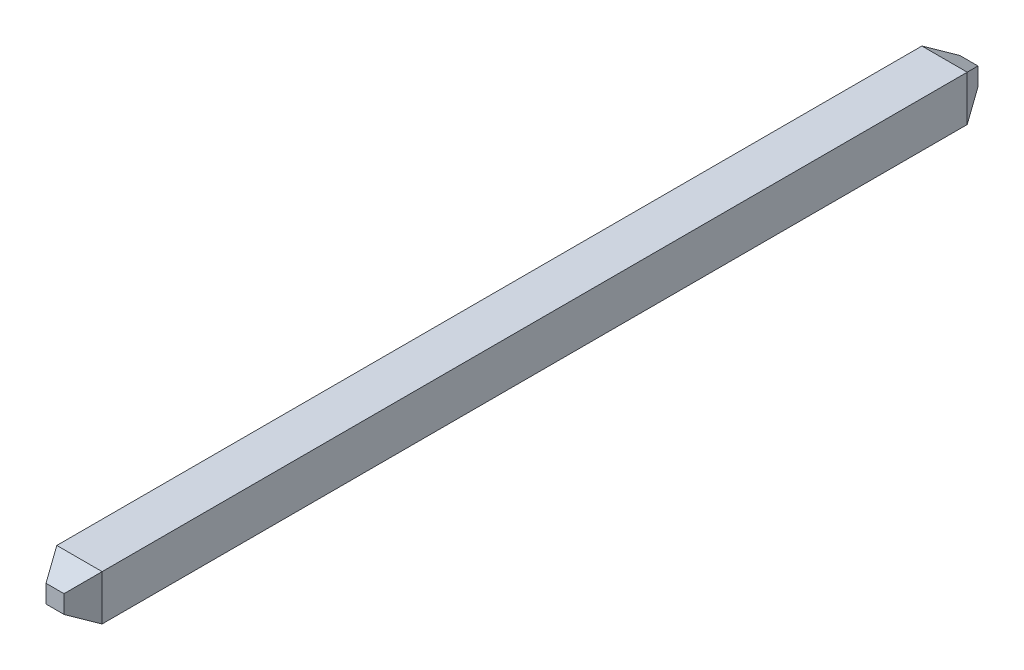
ISO-10303-21;
HEADER;
FILE_DESCRIPTION(('STEP AP214'),'2;1');
FILE_NAME('part.step','',(''),(''),'','','');
FILE_SCHEMA(('AUTOMOTIVE_DESIGN { 1 0 10303 214 1 1 1 1 }'));
ENDSEC;
DATA;
#1=APPLICATION_CONTEXT('core data for automotive mechanical design processes');
#2=APPLICATION_PROTOCOL_DEFINITION('international standard','automotive_design',2000,#1);
#3=PRODUCT_CONTEXT('',#1,'mechanical');
#4=PRODUCT('Part','Part','',(#3));
#5=PRODUCT_RELATED_PRODUCT_CATEGORY('part','',(#4));
#6=PRODUCT_DEFINITION_FORMATION('','',#4);
#7=PRODUCT_DEFINITION_CONTEXT('part definition',#1,'design');
#8=PRODUCT_DEFINITION('design','',#6,#7);
#9=PRODUCT_DEFINITION_SHAPE('','',#8);
#10=(LENGTH_UNIT() NAMED_UNIT(*) SI_UNIT(.MILLI.,.METRE.));
#11=(NAMED_UNIT(*) PLANE_ANGLE_UNIT() SI_UNIT($,.RADIAN.));
#12=(NAMED_UNIT(*) SI_UNIT($,.STERADIAN.) SOLID_ANGLE_UNIT());
#13=UNCERTAINTY_MEASURE_WITH_UNIT(LENGTH_MEASURE(1.E-05),#10,'distance_accuracy_value','');
#14=(GEOMETRIC_REPRESENTATION_CONTEXT(3) GLOBAL_UNCERTAINTY_ASSIGNED_CONTEXT((#13)) GLOBAL_UNIT_ASSIGNED_CONTEXT((#10,
#11,#12)) REPRESENTATION_CONTEXT('',''));
#15=CARTESIAN_POINT('',(0.,0.,0.));
#16=DIRECTION('',(0.,0.,1.));
#17=DIRECTION('',(1.,0.,0.));
#18=AXIS2_PLACEMENT_3D('',#15,#16,#17);
#19=CARTESIAN_POINT('',(7.74011510041924,0.945,-3.20872569516347));
#20=DIRECTION('',(0.872569516347452,0.,-0.488489958076083));
#21=DIRECTION('',(-0.488489958076083,0.,-0.872569516347452));
#22=AXIS2_PLACEMENT_3D('',#19,#20,#21);
#23=PLANE('',#22);
#24=DIRECTION('',(0.,1.,0.));
#25=VECTOR('',#24,1.);
#26=CARTESIAN_POINT('',(7.93534185664469,0.944999999999999,-2.86000017186176));
#27=LINE('',#26,#25);
#28=CARTESIAN_POINT('',(7.93534185663263,0.954999975315067,-2.85999984563027));
#29=VERTEX_POINT('',#28);
#30=CARTESIAN_POINT('',(7.93534201729187,1.58500016035866,-2.8599998849043));
#31=VERTEX_POINT('',#30);
#32=EDGE_CURVE('E146',#29,#31,#27,.T.);
#33=ORIENTED_EDGE('',*,*,#32,.F.);
#34=DIRECTION('',(0.43907261756865,-0.438284036988111,0.784297353956278));
#35=VECTOR('',#34,1.);
#36=CARTESIAN_POINT('',(7.745,1.145,-3.2));
#37=LINE('',#36,#35);
#38=CARTESIAN_POINT('',(7.745,1.145,-3.2));
#39=VERTEX_POINT('',#38);
#40=EDGE_CURVE('E143',#39,#29,#37,.T.);
#41=ORIENTED_EDGE('',*,*,#40,.F.);
#42=DIRECTION('',(0.,1.,0.));
#43=VECTOR('',#42,1.);
#44=CARTESIAN_POINT('',(7.745,1.135,-3.2));
#45=LINE('',#44,#43);
#46=CARTESIAN_POINT('',(7.745,1.395,-3.2));
#47=VERTEX_POINT('',#46);
#48=EDGE_CURVE('E95',#47,#39,#45,.F.);
#49=ORIENTED_EDGE('',*,*,#48,.F.);
#50=DIRECTION('',(-0.439072617568649,-0.438284036988111,-0.784297353956278));
#51=VECTOR('',#50,1.);
#52=CARTESIAN_POINT('',(7.93534185664468,1.585,-2.86000017186176));
#53=LINE('',#52,#51);
#54=EDGE_CURVE('E135',#31,#47,#53,.T.);
#55=ORIENTED_EDGE('',*,*,#54,.F.);
#56=EDGE_LOOP('',(#33,#41,#49,#55));
#57=FACE_BOUND('',#56,.T.);
#58=ADVANCED_FACE('F16',(#57),#23,.T.);
#59=CARTESIAN_POINT('',(7.74036702814295,0.945,9.50441734607014));
#60=DIRECTION('',(0.873317045523298,0.,0.487152273933376));
#61=DIRECTION('',(0.487152273933376,0.,-0.873317045523298));
#62=AXIS2_PLACEMENT_3D('',#59,#60,#61);
#63=PLANE('',#62);
#64=DIRECTION('',(-0.437799852400912,0.438586917260842,0.784839349959832));
#65=VECTOR('',#64,1.);
#66=CARTESIAN_POINT('',(7.93489789955165,0.954999686828527,9.15568378706484));
#67=LINE('',#66,#65);
#68=CARTESIAN_POINT('',(7.93489765454993,0.954999891076847,9.15568368845102));
#69=VERTEX_POINT('',#68);
#70=CARTESIAN_POINT('',(7.74523855088228,1.145,9.49568417561491));
#71=VERTEX_POINT('',#70);
#72=EDGE_CURVE('E152',#69,#71,#67,.T.);
#73=ORIENTED_EDGE('',*,*,#72,.F.);
#74=DIRECTION('',(0.,1.,0.));
#75=VECTOR('',#74,1.);
#76=CARTESIAN_POINT('',(7.93489853900643,0.944999999999999,9.15568372243698));
#77=LINE('',#76,#75);
#78=CARTESIAN_POINT('',(7.93489765280461,1.5850001770326,9.15568371270385));
#79=VERTEX_POINT('',#78);
#80=EDGE_CURVE('E106',#79,#69,#77,.F.);
#81=ORIENTED_EDGE('',*,*,#80,.F.);
#82=DIRECTION('',(0.437799852400914,0.438586917260841,-0.784839349959831));
#83=VECTOR('',#82,1.);
#84=CARTESIAN_POINT('',(7.74523855088228,1.395,9.49568417561491));
#85=LINE('',#84,#83);
#86=CARTESIAN_POINT('',(7.74523855088228,1.395,9.49568417561491));
#87=VERTEX_POINT('',#86);
#88=EDGE_CURVE('E101',#87,#79,#85,.T.);
#89=ORIENTED_EDGE('',*,*,#88,.F.);
#90=DIRECTION('',(0.,1.,0.));
#91=VECTOR('',#90,1.);
#92=CARTESIAN_POINT('',(7.74523855088228,1.405,9.49568417561491));
#93=LINE('',#92,#91);
#94=EDGE_CURVE('E19',#71,#87,#93,.T.);
#95=ORIENTED_EDGE('',*,*,#94,.F.);
#96=EDGE_LOOP('',(#73,#81,#89,#95));
#97=FACE_BOUND('',#96,.T.);
#98=ADVANCED_FACE('F103',(#97),#63,.T.);
#99=CARTESIAN_POINT('',(7.48523855088228,1.405,9.49568417561491));
#100=DIRECTION('',(0.,0.,1.));
#101=DIRECTION('',(1.,0.,0.));
#102=AXIS2_PLACEMENT_3D('',#99,#100,#101);
#103=PLANE('',#102);
#104=DIRECTION('',(1.,0.,0.));
#105=VECTOR('',#104,1.);
#106=CARTESIAN_POINT('',(7.2948966942376,1.395,9.49568417561491));
#107=LINE('',#106,#105);
#108=CARTESIAN_POINT('',(7.49523855088228,1.395,9.49568417561491));
#109=VERTEX_POINT('',#108);
#110=EDGE_CURVE('E111',#109,#87,#107,.T.);
#111=ORIENTED_EDGE('',*,*,#110,.F.);
#112=DIRECTION('',(0.,1.,0.));
#113=VECTOR('',#112,1.);
#114=CARTESIAN_POINT('',(7.49523855088228,0.945,9.49568417561491));
#115=LINE('',#114,#113);
#116=CARTESIAN_POINT('',(7.49523855088228,1.145,9.49568417561491));
#117=VERTEX_POINT('',#116);
#118=EDGE_CURVE('E162',#117,#109,#115,.T.);
#119=ORIENTED_EDGE('',*,*,#118,.F.);
#120=DIRECTION('',(1.,0.,0.));
#121=VECTOR('',#120,1.);
#122=CARTESIAN_POINT('',(7.2948966942376,1.145,9.49568417561491));
#123=LINE('',#122,#121);
#124=EDGE_CURVE('E116',#71,#117,#123,.F.);
#125=ORIENTED_EDGE('',*,*,#124,.F.);
#126=ORIENTED_EDGE('',*,*,#94,.T.);
#127=EDGE_LOOP('',(#111,#119,#125,#126));
#128=FACE_BOUND('',#127,.T.);
#129=ADVANCED_FACE('F113',(#128),#103,.T.);
#130=CARTESIAN_POINT('',(7.2948966942376,1.39012178454432,9.50441360938624));
#131=DIRECTION('',(0.,0.872943377132664,0.487821545567864));
#132=DIRECTION('',(0.,-0.487821545567864,0.872943377132664));
#133=AXIS2_PLACEMENT_3D('',#130,#131,#132);
#134=PLANE('',#133);
#135=DIRECTION('',(-0.439072459537927,0.438284700441663,-0.784297071672512));
#136=VECTOR('',#135,1.);
#137=CARTESIAN_POINT('',(7.49523855088228,1.395,9.49568417561491));
#138=LINE('',#137,#136);
#139=CARTESIAN_POINT('',(7.3048975037028,1.58500008247258,9.15568447138296));
#140=VERTEX_POINT('',#139);
#141=EDGE_CURVE('E121',#109,#140,#138,.T.);
#142=ORIENTED_EDGE('',*,*,#141,.F.);
#143=ORIENTED_EDGE('',*,*,#110,.T.);
#144=ORIENTED_EDGE('',*,*,#88,.T.);
#145=DIRECTION('',(1.,0.,0.));
#146=VECTOR('',#145,1.);
#147=CARTESIAN_POINT('',(7.62006658937282,1.585,9.15568497320463));
#148=LINE('',#147,#146);
#149=EDGE_CURVE('E165',#140,#79,#148,.T.);
#150=ORIENTED_EDGE('',*,*,#149,.F.);
#151=EDGE_LOOP('',(#142,#143,#144,#150));
#152=FACE_BOUND('',#151,.T.);
#153=ADVANCED_FACE('F119',(#152),#134,.T.);
#154=CARTESIAN_POINT('',(7.485,1.135,-3.2));
#155=DIRECTION('',(0.,0.,-1.));
#156=DIRECTION('',(-1.,0.,0.));
#157=AXIS2_PLACEMENT_3D('',#154,#155,#156);
#158=PLANE('',#157);
#159=ORIENTED_EDGE('',*,*,#48,.T.);
#160=DIRECTION('',(1.,0.,0.));
#161=VECTOR('',#160,1.);
#162=CARTESIAN_POINT('',(7.29534185664468,1.145,-3.2));
#163=LINE('',#162,#161);
#164=CARTESIAN_POINT('',(7.495,1.145,-3.2));
#165=VERTEX_POINT('',#164);
#166=EDGE_CURVE('E139',#165,#39,#163,.T.);
#167=ORIENTED_EDGE('',*,*,#166,.F.);
#168=DIRECTION('',(0.,1.,0.));
#169=VECTOR('',#168,1.);
#170=CARTESIAN_POINT('',(7.49500000000001,0.945,-3.2));
#171=LINE('',#170,#169);
#172=CARTESIAN_POINT('',(7.495,1.395,-3.2));
#173=VERTEX_POINT('',#172);
#174=EDGE_CURVE('E177',#173,#165,#171,.F.);
#175=ORIENTED_EDGE('',*,*,#174,.F.);
#176=DIRECTION('',(1.,0.,0.));
#177=VECTOR('',#176,1.);
#178=CARTESIAN_POINT('',(7.29534185664468,1.395,-3.2));
#179=LINE('',#178,#177);
#180=EDGE_CURVE('E129',#47,#173,#179,.F.);
#181=ORIENTED_EDGE('',*,*,#180,.F.);
#182=EDGE_LOOP('',(#159,#167,#175,#181));
#183=FACE_BOUND('',#182,.T.);
#184=ADVANCED_FACE('F229',(#183),#158,.T.);
#185=CARTESIAN_POINT('',(7.29534185664468,1.58987821545568,-2.85127073809043));
#186=DIRECTION('',(0.,0.872943377132663,-0.487821545567865));
#187=DIRECTION('',(0.,0.487821545567865,0.872943377132663));
#188=AXIS2_PLACEMENT_3D('',#185,#186,#187);
#189=PLANE('',#188);
#190=DIRECTION('',(1.,0.,0.));
#191=VECTOR('',#190,1.);
#192=CARTESIAN_POINT('',(7.62006658937282,1.585,-2.86000017186176));
#193=LINE('',#192,#191);
#194=CARTESIAN_POINT('',(7.30534144768619,1.58500070680911,-2.8599984305592));
#195=VERTEX_POINT('',#194);
#196=EDGE_CURVE('E173',#31,#195,#193,.F.);
#197=ORIENTED_EDGE('',*,*,#196,.F.);
#198=ORIENTED_EDGE('',*,*,#54,.T.);
#199=ORIENTED_EDGE('',*,*,#180,.T.);
#200=DIRECTION('',(0.437798396819596,-0.43858642908966,-0.784840434713052));
#201=VECTOR('',#200,1.);
#202=CARTESIAN_POINT('',(7.30534066407532,1.58500072063078,-2.8599980339447));
#203=LINE('',#202,#201);
#204=EDGE_CURVE('E184',#195,#173,#203,.T.);
#205=ORIENTED_EDGE('',*,*,#204,.F.);
#206=EDGE_LOOP('',(#197,#198,#199,#205));
#207=FACE_BOUND('',#206,.T.);
#208=ADVANCED_FACE('F227',(#207),#189,.T.);
#209=CARTESIAN_POINT('',(7.29534185664468,1.14987821545568,-3.20872943377133));
#210=DIRECTION('',(0.,-0.872943377132663,-0.487821545567865));
#211=DIRECTION('',(0.,0.487821545567865,-0.872943377132663));
#212=AXIS2_PLACEMENT_3D('',#209,#210,#211);
#213=PLANE('',#212);
#214=ORIENTED_EDGE('',*,*,#166,.T.);
#215=ORIENTED_EDGE('',*,*,#40,.T.);
#216=DIRECTION('',(1.,0.,0.));
#217=VECTOR('',#216,1.);
#218=CARTESIAN_POINT('',(7.29494834685547,0.955,-2.85999756200982));
#219=LINE('',#218,#217);
#220=CARTESIAN_POINT('',(7.30534198218489,0.954999729763457,-2.85999898491791));
#221=VERTEX_POINT('',#220);
#222=EDGE_CURVE('E39',#221,#29,#219,.T.);
#223=ORIENTED_EDGE('',*,*,#222,.F.);
#224=DIRECTION('',(-0.437798396819595,-0.438586429089664,0.78484043471305));
#225=VECTOR('',#224,1.);
#226=CARTESIAN_POINT('',(7.49500000000001,1.145,-3.2));
#227=LINE('',#226,#225);
#228=EDGE_CURVE('E181',#165,#221,#227,.T.);
#229=ORIENTED_EDGE('',*,*,#228,.F.);
#230=EDGE_LOOP('',(#214,#215,#223,#229));
#231=FACE_BOUND('',#230,.T.);
#232=ADVANCED_FACE('F230',(#231),#213,.T.);
#233=CARTESIAN_POINT('',(7.93534630826876,0.944999999999999,-2.98065701705514));
#234=DIRECTION('',(0.999999999319383,0.,3.68949151671205E-05));
#235=DIRECTION('',(3.68949151671205E-05,0.,-0.999999999319383));
#236=AXIS2_PLACEMENT_3D('',#233,#234,#235);
#237=PLANE('',#236);
#238=DIRECTION('',(3.69481335090154E-05,0.,-0.999999999317418));
#239=VECTOR('',#238,1.);
#240=CARTESIAN_POINT('',(7.93489789955165,1.585,9.15568372241339));
#241=LINE('',#240,#239);
#242=EDGE_CURVE('E169',#79,#31,#241,.T.);
#243=ORIENTED_EDGE('',*,*,#242,.F.);
#244=ORIENTED_EDGE('',*,*,#80,.T.);
#245=DIRECTION('',(-3.69481335090154E-05,0.,0.999999999317418));
#246=VECTOR('',#245,1.);
#247=CARTESIAN_POINT('',(7.93534185664468,0.955,-2.86000017186176));
#248=LINE('',#247,#246);
#249=EDGE_CURVE('E190',#29,#69,#248,.T.);
#250=ORIENTED_EDGE('',*,*,#249,.F.);
#251=ORIENTED_EDGE('',*,*,#32,.T.);
#252=EDGE_LOOP('',(#243,#244,#250,#251));
#253=FACE_BOUND('',#252,.T.);
#254=ADVANCED_FACE('F232',(#253),#237,.T.);
#255=CARTESIAN_POINT('',(7.2948966942376,0.950121784544321,9.14695491370534));
#256=DIRECTION('',(0.,-0.872943377132664,0.487821545567865));
#257=DIRECTION('',(0.,-0.487821545567865,-0.872943377132664));
#258=AXIS2_PLACEMENT_3D('',#255,#256,#257);
#259=PLANE('',#258);
#260=ORIENTED_EDGE('',*,*,#124,.T.);
#261=DIRECTION('',(0.439072459537929,0.438284700441656,0.784297071672515));
#262=VECTOR('',#261,1.);
#263=CARTESIAN_POINT('',(7.30489724886555,0.955000197635094,9.15568533818574));
#264=LINE('',#263,#262);
#265=CARTESIAN_POINT('',(7.30489781760238,0.955000116075706,9.15568487573227));
#266=VERTEX_POINT('',#265);
#267=EDGE_CURVE('E158',#266,#117,#264,.T.);
#268=ORIENTED_EDGE('',*,*,#267,.F.);
#269=DIRECTION('',(1.,0.,0.));
#270=VECTOR('',#269,1.);
#271=CARTESIAN_POINT('',(7.29494834685547,0.955,9.15568372241339));
#272=LINE('',#271,#270);
#273=EDGE_CURVE('E194',#69,#266,#272,.F.);
#274=ORIENTED_EDGE('',*,*,#273,.F.);
#275=ORIENTED_EDGE('',*,*,#72,.T.);
#276=EDGE_LOOP('',(#260,#268,#274,#275));
#277=FACE_BOUND('',#276,.T.);
#278=ADVANCED_FACE('F219',(#277),#259,.T.);
#279=CARTESIAN_POINT('',(7.50012345046305,0.945,9.50440987077839));
#280=DIRECTION('',(-0.872569516347454,0.,0.48848995807608));
#281=DIRECTION('',(0.48848995807608,0.,0.872569516347454));
#282=AXIS2_PLACEMENT_3D('',#279,#280,#281);
#283=PLANE('',#282);
#284=ORIENTED_EDGE('',*,*,#267,.T.);
#285=ORIENTED_EDGE('',*,*,#118,.T.);
#286=ORIENTED_EDGE('',*,*,#141,.T.);
#287=DIRECTION('',(0.,1.,0.));
#288=VECTOR('',#287,1.);
#289=CARTESIAN_POINT('',(7.30489853896028,0.945,9.15568497322817));
#290=LINE('',#289,#288);
#291=EDGE_CURVE('E197',#266,#140,#290,.T.);
#292=ORIENTED_EDGE('',*,*,#291,.F.);
#293=EDGE_LOOP('',(#284,#285,#286,#292));
#294=FACE_BOUND('',#293,.T.);
#295=ADVANCED_FACE('F222',(#294),#283,.T.);
#296=CARTESIAN_POINT('',(7.62006658937282,1.585,9.32634470275115));
#297=DIRECTION('',(0.,1.,0.));
#298=DIRECTION('',(0.,0.,1.));
#299=AXIS2_PLACEMENT_3D('',#296,#297,#298);
#300=PLANE('',#299);
#301=ORIENTED_EDGE('',*,*,#196,.T.);
#302=DIRECTION('',(-3.68949151674615E-05,0.,0.999999999319383));
#303=VECTOR('',#302,1.);
#304=CARTESIAN_POINT('',(7.30489224235438,1.58499980236491,9.32634821671993));
#305=LINE('',#304,#303);
#306=EDGE_CURVE('E201',#140,#195,#305,.F.);
#307=ORIENTED_EDGE('',*,*,#306,.F.);
#308=ORIENTED_EDGE('',*,*,#149,.T.);
#309=ORIENTED_EDGE('',*,*,#242,.T.);
#310=EDGE_LOOP('',(#301,#307,#308,#309));
#311=FACE_BOUND('',#310,.T.);
#312=ADVANCED_FACE('F224',(#311),#300,.T.);
#313=CARTESIAN_POINT('',(7.49987152273934,0.945,-3.20873317045523));
#314=DIRECTION('',(-0.873317045523296,0.,-0.487152273933378));
#315=DIRECTION('',(-0.487152273933378,0.,0.873317045523296));
#316=AXIS2_PLACEMENT_3D('',#313,#314,#315);
#317=PLANE('',#316);
#318=DIRECTION('',(0.,1.,0.));
#319=VECTOR('',#318,1.);
#320=CARTESIAN_POINT('',(7.30534185654839,0.945,-2.85999756199704));
#321=LINE('',#320,#319);
#322=EDGE_CURVE('E26',#195,#221,#321,.F.);
#323=ORIENTED_EDGE('',*,*,#322,.F.);
#324=ORIENTED_EDGE('',*,*,#204,.T.);
#325=ORIENTED_EDGE('',*,*,#174,.T.);
#326=ORIENTED_EDGE('',*,*,#228,.T.);
#327=EDGE_LOOP('',(#323,#324,#325,#326));
#328=FACE_BOUND('',#327,.T.);
#329=ADVANCED_FACE('F213',(#328),#317,.T.);
#330=CARTESIAN_POINT('',(7.29494834685547,0.955,3.17284922525592));
#331=DIRECTION('',(0.,-1.,0.));
#332=DIRECTION('',(0.,0.,-1.));
#333=AXIS2_PLACEMENT_3D('',#330,#331,#332);
#334=PLANE('',#333);
#335=ORIENTED_EDGE('',*,*,#249,.T.);
#336=ORIENTED_EDGE('',*,*,#273,.T.);
#337=DIRECTION('',(-3.68949151674615E-05,0.,0.999999999319383));
#338=VECTOR('',#337,1.);
#339=CARTESIAN_POINT('',(7.30489224235438,0.954999279369218,9.32634821671993));
#340=LINE('',#339,#338);
#341=EDGE_CURVE('E11',#221,#266,#340,.T.);
#342=ORIENTED_EDGE('',*,*,#341,.F.);
#343=ORIENTED_EDGE('',*,*,#222,.T.);
#344=EDGE_LOOP('',(#335,#336,#342,#343));
#345=FACE_BOUND('',#344,.T.);
#346=ADVANCED_FACE('F215',(#345),#334,.T.);
#347=CARTESIAN_POINT('',(7.30489224235438,0.945,9.32634821671993));
#348=DIRECTION('',(-0.999999999319383,0.,-3.68949151674615E-05));
#349=DIRECTION('',(-3.68949151674615E-05,0.,0.999999999319383));
#350=AXIS2_PLACEMENT_3D('',#347,#348,#349);
#351=PLANE('',#350);
#352=ORIENTED_EDGE('',*,*,#322,.T.);
#353=ORIENTED_EDGE('',*,*,#341,.T.);
#354=ORIENTED_EDGE('',*,*,#291,.T.);
#355=ORIENTED_EDGE('',*,*,#306,.T.);
#356=EDGE_LOOP('',(#352,#353,#354,#355));
#357=FACE_BOUND('',#356,.T.);
#358=ADVANCED_FACE('F209',(#357),#351,.T.);
#359=CLOSED_SHELL('',(#58,#98,#129,#153,#184,#208,#232,#254,#278,#295,#312,#329,#346,#358));
#360=MANIFOLD_SOLID_BREP('B1',#359);
#361=ADVANCED_BREP_SHAPE_REPRESENTATION('',(#18,#360),#14);
#362=SHAPE_DEFINITION_REPRESENTATION(#9,#361);
ENDSEC;
END-ISO-10303-21;
